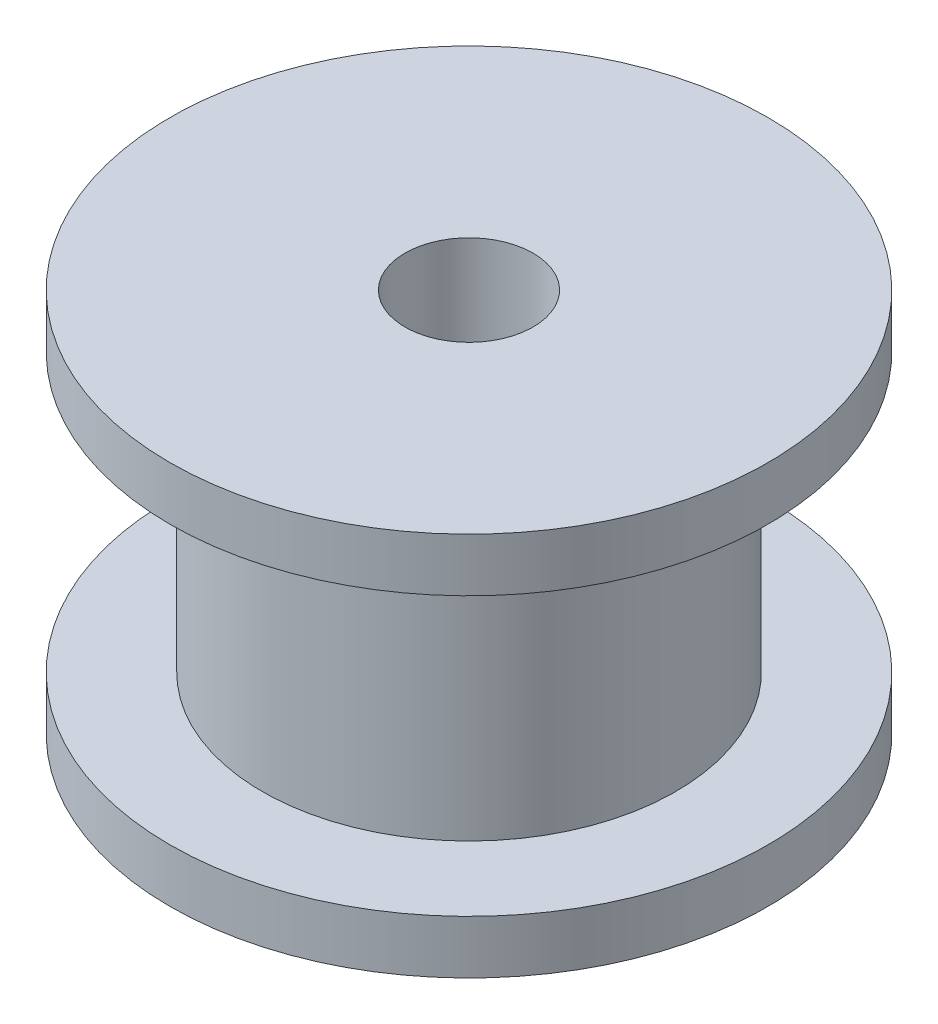
ISO-10303-21;
HEADER;
FILE_DESCRIPTION(('STEP AP214'),'2;1');
FILE_NAME('part.step','',(''),(''),'','','');
FILE_SCHEMA(('AUTOMOTIVE_DESIGN { 1 0 10303 214 1 1 1 1 }'));
ENDSEC;
DATA;
#1=APPLICATION_CONTEXT('core data for automotive mechanical design processes');
#2=APPLICATION_PROTOCOL_DEFINITION('international standard','automotive_design',2000,#1);
#3=PRODUCT_CONTEXT('',#1,'mechanical');
#4=PRODUCT('Part','Part','',(#3));
#5=PRODUCT_RELATED_PRODUCT_CATEGORY('part','',(#4));
#6=PRODUCT_DEFINITION_FORMATION('','',#4);
#7=PRODUCT_DEFINITION_CONTEXT('part definition',#1,'design');
#8=PRODUCT_DEFINITION('design','',#6,#7);
#9=PRODUCT_DEFINITION_SHAPE('','',#8);
#10=(LENGTH_UNIT() NAMED_UNIT(*) SI_UNIT(.MILLI.,.METRE.));
#11=(NAMED_UNIT(*) PLANE_ANGLE_UNIT() SI_UNIT($,.RADIAN.));
#12=(NAMED_UNIT(*) SI_UNIT($,.STERADIAN.) SOLID_ANGLE_UNIT());
#13=UNCERTAINTY_MEASURE_WITH_UNIT(LENGTH_MEASURE(1.E-05),#10,'distance_accuracy_value','');
#14=(GEOMETRIC_REPRESENTATION_CONTEXT(3) GLOBAL_UNCERTAINTY_ASSIGNED_CONTEXT((#13)) GLOBAL_UNIT_ASSIGNED_CONTEXT((#10,
#11,#12)) REPRESENTATION_CONTEXT('',''));
#15=CARTESIAN_POINT('',(0.,0.,0.));
#16=DIRECTION('',(0.,0.,1.));
#17=DIRECTION('',(1.,0.,0.));
#18=AXIS2_PLACEMENT_3D('',#15,#16,#17);
#19=CARTESIAN_POINT('',(0.,0.,0.));
#20=DIRECTION('',(0.,-1.,0.));
#21=DIRECTION('',(0.,0.,-1.));
#22=AXIS2_PLACEMENT_3D('',#19,#20,#21);
#23=CYLINDRICAL_SURFACE('',#22,1.5);
#24=CARTESIAN_POINT('',(0.,0.,0.));
#25=DIRECTION('',(0.,-1.,0.));
#26=DIRECTION('',(0.,0.,-1.));
#27=AXIS2_PLACEMENT_3D('',#24,#25,#26);
#28=CIRCLE('',#27,1.5);
#29=CARTESIAN_POINT('',(0.,0.,-1.5));
#30=VERTEX_POINT('',#29);
#31=EDGE_CURVE('E58',#30,#30,#28,.T.);
#32=ORIENTED_EDGE('',*,*,#31,.T.);
#33=EDGE_LOOP('',(#32));
#34=FACE_BOUND('',#33,.T.);
#35=CARTESIAN_POINT('',(0.,9.,0.));
#36=DIRECTION('',(0.,-1.,0.));
#37=DIRECTION('',(0.,0.,-1.));
#38=AXIS2_PLACEMENT_3D('',#35,#36,#37);
#39=CIRCLE('',#38,1.5);
#40=CARTESIAN_POINT('',(0.,9.,-1.5));
#41=VERTEX_POINT('',#40);
#42=EDGE_CURVE('E10',#41,#41,#39,.T.);
#43=ORIENTED_EDGE('',*,*,#42,.F.);
#44=EDGE_LOOP('',(#43));
#45=FACE_BOUND('',#44,.T.);
#46=ADVANCED_FACE('F30',(#34,#45),#23,.F.);
#47=CARTESIAN_POINT('',(1.5,9.,0.));
#48=DIRECTION('',(0.,1.,0.));
#49=DIRECTION('',(0.,0.,1.));
#50=AXIS2_PLACEMENT_3D('',#47,#48,#49);
#51=PLANE('',#50);
#52=ORIENTED_EDGE('',*,*,#42,.T.);
#53=EDGE_LOOP('',(#52));
#54=FACE_BOUND('',#53,.T.);
#55=CARTESIAN_POINT('',(0.,9.,0.));
#56=DIRECTION('',(0.,-1.,0.));
#57=DIRECTION('',(0.,0.,-1.));
#58=AXIS2_PLACEMENT_3D('',#55,#56,#57);
#59=CIRCLE('',#58,7.);
#60=CARTESIAN_POINT('',(0.,9.,-7.));
#61=VERTEX_POINT('',#60);
#62=EDGE_CURVE('E36',#61,#61,#59,.T.);
#63=ORIENTED_EDGE('',*,*,#62,.F.);
#64=EDGE_LOOP('',(#63));
#65=FACE_BOUND('',#64,.T.);
#66=ADVANCED_FACE('F76',(#54,#65),#51,.T.);
#67=CARTESIAN_POINT('',(0.,0.,0.));
#68=DIRECTION('',(0.,-1.,0.));
#69=DIRECTION('',(0.,0.,-1.));
#70=AXIS2_PLACEMENT_3D('',#67,#68,#69);
#71=CYLINDRICAL_SURFACE('',#70,7.);
#72=ORIENTED_EDGE('',*,*,#62,.T.);
#73=EDGE_LOOP('',(#72));
#74=FACE_BOUND('',#73,.T.);
#75=CARTESIAN_POINT('',(0.,7.75,0.));
#76=DIRECTION('',(0.,-1.,0.));
#77=DIRECTION('',(0.,0.,-1.));
#78=AXIS2_PLACEMENT_3D('',#75,#76,#77);
#79=CIRCLE('',#78,7.);
#80=CARTESIAN_POINT('',(0.,7.75,-7.));
#81=VERTEX_POINT('',#80);
#82=EDGE_CURVE('E40',#81,#81,#79,.T.);
#83=ORIENTED_EDGE('',*,*,#82,.F.);
#84=EDGE_LOOP('',(#83));
#85=FACE_BOUND('',#84,.T.);
#86=ADVANCED_FACE('F80',(#74,#85),#71,.T.);
#87=CARTESIAN_POINT('',(7.,7.75,0.));
#88=DIRECTION('',(0.,-1.,0.));
#89=DIRECTION('',(0.,0.,-1.));
#90=AXIS2_PLACEMENT_3D('',#87,#88,#89);
#91=PLANE('',#90);
#92=ORIENTED_EDGE('',*,*,#82,.T.);
#93=EDGE_LOOP('',(#92));
#94=FACE_BOUND('',#93,.T.);
#95=CARTESIAN_POINT('',(0.,7.75,0.));
#96=DIRECTION('',(0.,-1.,0.));
#97=DIRECTION('',(0.,0.,-1.));
#98=AXIS2_PLACEMENT_3D('',#95,#96,#97);
#99=CIRCLE('',#98,4.84);
#100=CARTESIAN_POINT('',(0.,7.75,-4.84));
#101=VERTEX_POINT('',#100);
#102=EDGE_CURVE('E44',#101,#101,#99,.T.);
#103=ORIENTED_EDGE('',*,*,#102,.F.);
#104=EDGE_LOOP('',(#103));
#105=FACE_BOUND('',#104,.T.);
#106=ADVANCED_FACE('F84',(#94,#105),#91,.T.);
#107=CARTESIAN_POINT('',(0.,0.,0.));
#108=DIRECTION('',(0.,-1.,0.));
#109=DIRECTION('',(0.,0.,-1.));
#110=AXIS2_PLACEMENT_3D('',#107,#108,#109);
#111=CYLINDRICAL_SURFACE('',#110,4.84);
#112=ORIENTED_EDGE('',*,*,#102,.T.);
#113=EDGE_LOOP('',(#112));
#114=FACE_BOUND('',#113,.T.);
#115=CARTESIAN_POINT('',(0.,1.25,0.));
#116=DIRECTION('',(0.,-1.,0.));
#117=DIRECTION('',(0.,0.,-1.));
#118=AXIS2_PLACEMENT_3D('',#115,#116,#117);
#119=CIRCLE('',#118,4.84);
#120=CARTESIAN_POINT('',(0.,1.25,-4.84));
#121=VERTEX_POINT('',#120);
#122=EDGE_CURVE('E49',#121,#121,#119,.T.);
#123=ORIENTED_EDGE('',*,*,#122,.F.);
#124=EDGE_LOOP('',(#123));
#125=FACE_BOUND('',#124,.T.);
#126=ADVANCED_FACE('F90',(#114,#125),#111,.T.);
#127=CARTESIAN_POINT('',(4.84,1.25,0.));
#128=DIRECTION('',(0.,1.,0.));
#129=DIRECTION('',(0.,0.,1.));
#130=AXIS2_PLACEMENT_3D('',#127,#128,#129);
#131=PLANE('',#130);
#132=ORIENTED_EDGE('',*,*,#122,.T.);
#133=EDGE_LOOP('',(#132));
#134=FACE_BOUND('',#133,.T.);
#135=CARTESIAN_POINT('',(0.,1.25,0.));
#136=DIRECTION('',(0.,-1.,0.));
#137=DIRECTION('',(0.,0.,-1.));
#138=AXIS2_PLACEMENT_3D('',#135,#136,#137);
#139=CIRCLE('',#138,7.);
#140=CARTESIAN_POINT('',(0.,1.25,-7.));
#141=VERTEX_POINT('',#140);
#142=EDGE_CURVE('E52',#141,#141,#139,.T.);
#143=ORIENTED_EDGE('',*,*,#142,.F.);
#144=EDGE_LOOP('',(#143));
#145=FACE_BOUND('',#144,.T.);
#146=ADVANCED_FACE('F72',(#134,#145),#131,.T.);
#147=CARTESIAN_POINT('',(0.,0.,0.));
#148=DIRECTION('',(0.,-1.,0.));
#149=DIRECTION('',(0.,0.,-1.));
#150=AXIS2_PLACEMENT_3D('',#147,#148,#149);
#151=CYLINDRICAL_SURFACE('',#150,7.);
#152=ORIENTED_EDGE('',*,*,#142,.T.);
#153=EDGE_LOOP('',(#152));
#154=FACE_BOUND('',#153,.T.);
#155=CARTESIAN_POINT('',(0.,0.,0.));
#156=DIRECTION('',(0.,-1.,0.));
#157=DIRECTION('',(0.,0.,-1.));
#158=AXIS2_PLACEMENT_3D('',#155,#156,#157);
#159=CIRCLE('',#158,7.);
#160=CARTESIAN_POINT('',(0.,0.,-7.));
#161=VERTEX_POINT('',#160);
#162=EDGE_CURVE('E55',#161,#161,#159,.T.);
#163=ORIENTED_EDGE('',*,*,#162,.F.);
#164=EDGE_LOOP('',(#163));
#165=FACE_BOUND('',#164,.T.);
#166=ADVANCED_FACE('F66',(#154,#165),#151,.T.);
#167=CARTESIAN_POINT('',(7.,0.,0.));
#168=DIRECTION('',(0.,-1.,0.));
#169=DIRECTION('',(0.,0.,-1.));
#170=AXIS2_PLACEMENT_3D('',#167,#168,#169);
#171=PLANE('',#170);
#172=ORIENTED_EDGE('',*,*,#162,.T.);
#173=EDGE_LOOP('',(#172));
#174=FACE_BOUND('',#173,.T.);
#175=ORIENTED_EDGE('',*,*,#31,.F.);
#176=EDGE_LOOP('',(#175));
#177=FACE_BOUND('',#176,.T.);
#178=ADVANCED_FACE('F64',(#174,#177),#171,.T.);
#179=CLOSED_SHELL('',(#46,#66,#86,#106,#126,#146,#166,#178));
#180=MANIFOLD_SOLID_BREP('B2',#179);
#181=ADVANCED_BREP_SHAPE_REPRESENTATION('',(#18,#180),#14);
#182=SHAPE_DEFINITION_REPRESENTATION(#9,#181);
ENDSEC;
END-ISO-10303-21;
